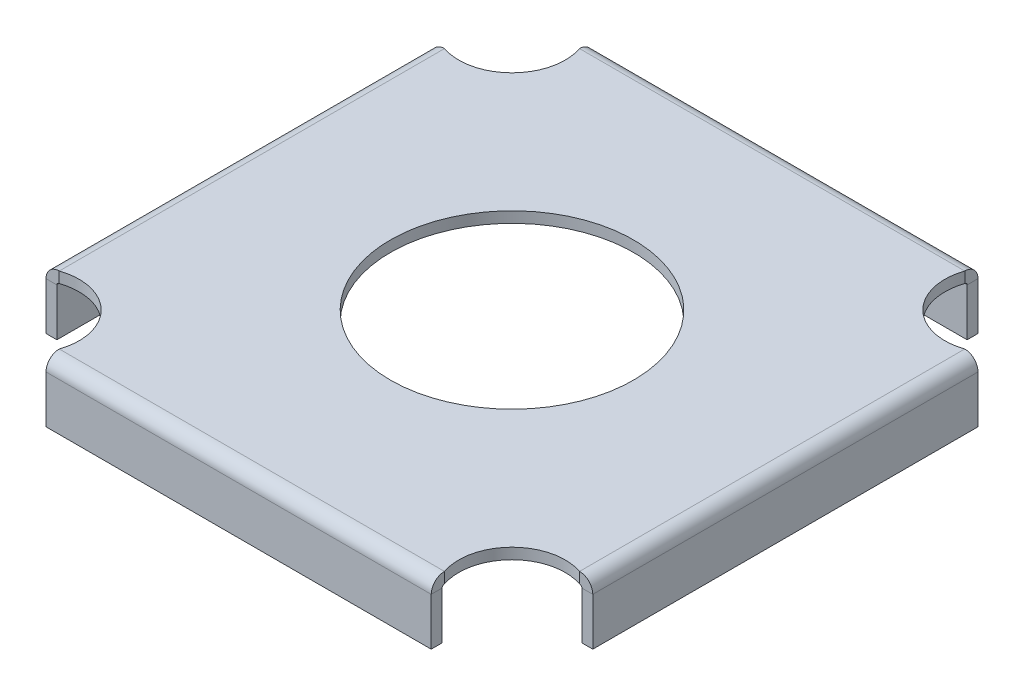
ISO-10303-21;
HEADER;
FILE_DESCRIPTION(('STEP AP214'),'2;1');
FILE_NAME('part.step','',(''),(''),'','','');
FILE_SCHEMA(('AUTOMOTIVE_DESIGN { 1 0 10303 214 1 1 1 1 }'));
ENDSEC;
DATA;
#1=APPLICATION_CONTEXT('core data for automotive mechanical design processes');
#2=APPLICATION_PROTOCOL_DEFINITION('international standard','automotive_design',2000,#1);
#3=PRODUCT_CONTEXT('',#1,'mechanical');
#4=PRODUCT('Part','Part','',(#3));
#5=PRODUCT_RELATED_PRODUCT_CATEGORY('part','',(#4));
#6=PRODUCT_DEFINITION_FORMATION('','',#4);
#7=PRODUCT_DEFINITION_CONTEXT('part definition',#1,'design');
#8=PRODUCT_DEFINITION('design','',#6,#7);
#9=PRODUCT_DEFINITION_SHAPE('','',#8);
#10=(LENGTH_UNIT() NAMED_UNIT(*) SI_UNIT(.MILLI.,.METRE.));
#11=(NAMED_UNIT(*) PLANE_ANGLE_UNIT() SI_UNIT($,.RADIAN.));
#12=(NAMED_UNIT(*) SI_UNIT($,.STERADIAN.) SOLID_ANGLE_UNIT());
#13=UNCERTAINTY_MEASURE_WITH_UNIT(LENGTH_MEASURE(1.E-05),#10,'distance_accuracy_value','');
#14=(GEOMETRIC_REPRESENTATION_CONTEXT(3) GLOBAL_UNCERTAINTY_ASSIGNED_CONTEXT((#13)) GLOBAL_UNIT_ASSIGNED_CONTEXT((#10,
#11,#12)) REPRESENTATION_CONTEXT('',''));
#15=CARTESIAN_POINT('',(0.,0.,0.));
#16=DIRECTION('',(0.,0.,1.));
#17=DIRECTION('',(1.,0.,0.));
#18=AXIS2_PLACEMENT_3D('',#15,#16,#17);
#19=CARTESIAN_POINT('',(76.2,-3.4163,76.2));
#20=DIRECTION('',(0.,1.,0.));
#21=DIRECTION('',(0.,0.,1.));
#22=AXIS2_PLACEMENT_3D('',#19,#20,#21);
#23=CYLINDRICAL_SURFACE('',#22,16.7005);
#24=CARTESIAN_POINT('',(76.2,0.,76.2));
#25=DIRECTION('',(0.,-1.,0.));
#26=DIRECTION('',(0.,0.,1.));
#27=AXIS2_PLACEMENT_3D('',#24,#25,#26);
#28=CIRCLE('',#27,16.7005);
#29=CARTESIAN_POINT('',(60.3828089759907,0.,81.5594));
#30=VERTEX_POINT('',#29);
#31=CARTESIAN_POINT('',(81.5594,0.,60.3828089759907));
#32=VERTEX_POINT('',#31);
#33=EDGE_CURVE('E467',#30,#32,#28,.T.);
#34=ORIENTED_EDGE('',*,*,#33,.F.);
#35=DIRECTION('',(0.,1.,0.));
#36=VECTOR('',#35,1.);
#37=CARTESIAN_POINT('',(60.3828089759907,-3.4163,81.5594));
#38=LINE('',#37,#36);
#39=CARTESIAN_POINT('',(60.3828089759907,-3.41629999999999,81.5594));
#40=VERTEX_POINT('',#39);
#41=EDGE_CURVE('E13',#40,#30,#38,.T.);
#42=ORIENTED_EDGE('',*,*,#41,.F.);
#43=CARTESIAN_POINT('',(76.2,-3.4163,76.2));
#44=DIRECTION('',(0.,-1.,0.));
#45=DIRECTION('',(0.,0.,1.));
#46=AXIS2_PLACEMENT_3D('',#43,#44,#45);
#47=CIRCLE('',#46,16.7005);
#48=CARTESIAN_POINT('',(81.5594,-3.4163,60.3828089759907));
#49=VERTEX_POINT('',#48);
#50=EDGE_CURVE('E470',#40,#49,#47,.T.);
#51=ORIENTED_EDGE('',*,*,#50,.T.);
#52=DIRECTION('',(0.,1.,0.));
#53=VECTOR('',#52,1.);
#54=CARTESIAN_POINT('',(81.5594,-3.4163,60.3828089759907));
#55=LINE('',#54,#53);
#56=EDGE_CURVE('E124',#49,#32,#55,.T.);
#57=ORIENTED_EDGE('',*,*,#56,.T.);
#58=EDGE_LOOP('',(#34,#42,#51,#57));
#59=FACE_BOUND('',#58,.T.);
#60=ADVANCED_FACE('F121',(#59),#23,.F.);
#61=CARTESIAN_POINT('',(-76.2,-3.4163,76.2));
#62=DIRECTION('',(0.,1.,0.));
#63=DIRECTION('',(0.,0.,1.));
#64=AXIS2_PLACEMENT_3D('',#61,#62,#63);
#65=CYLINDRICAL_SURFACE('',#64,16.7005);
#66=CARTESIAN_POINT('',(-76.2,0.,76.2));
#67=DIRECTION('',(0.,-1.,0.));
#68=DIRECTION('',(0.,0.,1.));
#69=AXIS2_PLACEMENT_3D('',#66,#67,#68);
#70=CIRCLE('',#69,16.7005);
#71=CARTESIAN_POINT('',(-81.5594,0.,60.3828089759907));
#72=VERTEX_POINT('',#71);
#73=CARTESIAN_POINT('',(-60.3828089759907,0.,81.5594));
#74=VERTEX_POINT('',#73);
#75=EDGE_CURVE('E508',#72,#74,#70,.T.);
#76=ORIENTED_EDGE('',*,*,#75,.F.);
#77=DIRECTION('',(0.,1.,0.));
#78=VECTOR('',#77,1.);
#79=CARTESIAN_POINT('',(-81.5594,-3.4163,60.3828089759907));
#80=LINE('',#79,#78);
#81=CARTESIAN_POINT('',(-81.5594,-3.4163,60.3828089759907));
#82=VERTEX_POINT('',#81);
#83=EDGE_CURVE('E515',#82,#72,#80,.T.);
#84=ORIENTED_EDGE('',*,*,#83,.F.);
#85=CARTESIAN_POINT('',(-76.2,-3.4163,76.2));
#86=DIRECTION('',(0.,-1.,0.));
#87=DIRECTION('',(0.,0.,1.));
#88=AXIS2_PLACEMENT_3D('',#85,#86,#87);
#89=CIRCLE('',#88,16.7005);
#90=CARTESIAN_POINT('',(-60.3828089759907,-3.41629999999999,81.5594));
#91=VERTEX_POINT('',#90);
#92=EDGE_CURVE('E486',#82,#91,#89,.T.);
#93=ORIENTED_EDGE('',*,*,#92,.T.);
#94=DIRECTION('',(0.,1.,0.));
#95=VECTOR('',#94,1.);
#96=CARTESIAN_POINT('',(-60.3828089759907,-3.4163,81.5594));
#97=LINE('',#96,#95);
#98=EDGE_CURVE('E129',#91,#74,#97,.T.);
#99=ORIENTED_EDGE('',*,*,#98,.T.);
#100=EDGE_LOOP('',(#76,#84,#93,#99));
#101=FACE_BOUND('',#100,.T.);
#102=ADVANCED_FACE('F547',(#101),#65,.F.);
#103=CARTESIAN_POINT('',(-76.2,-3.4163,-76.2));
#104=DIRECTION('',(0.,1.,0.));
#105=DIRECTION('',(0.,0.,1.));
#106=AXIS2_PLACEMENT_3D('',#103,#104,#105);
#107=CYLINDRICAL_SURFACE('',#106,16.7005);
#108=CARTESIAN_POINT('',(-76.2,0.,-76.2));
#109=DIRECTION('',(0.,-1.,0.));
#110=DIRECTION('',(0.,0.,1.));
#111=AXIS2_PLACEMENT_3D('',#108,#109,#110);
#112=CIRCLE('',#111,16.7005);
#113=CARTESIAN_POINT('',(-60.3828089759907,0.,-81.5594));
#114=VERTEX_POINT('',#113);
#115=CARTESIAN_POINT('',(-81.5594,0.,-60.3828089759907));
#116=VERTEX_POINT('',#115);
#117=EDGE_CURVE('E502',#114,#116,#112,.T.);
#118=ORIENTED_EDGE('',*,*,#117,.F.);
#119=DIRECTION('',(0.,1.,0.));
#120=VECTOR('',#119,1.);
#121=CARTESIAN_POINT('',(-60.3828089759907,-3.4163,-81.5594));
#122=LINE('',#121,#120);
#123=CARTESIAN_POINT('',(-60.3828089759907,-3.4163,-81.5594));
#124=VERTEX_POINT('',#123);
#125=EDGE_CURVE('E520',#124,#114,#122,.T.);
#126=ORIENTED_EDGE('',*,*,#125,.F.);
#127=CARTESIAN_POINT('',(-76.2,-3.4163,-76.2));
#128=DIRECTION('',(0.,-1.,0.));
#129=DIRECTION('',(0.,0.,1.));
#130=AXIS2_PLACEMENT_3D('',#127,#128,#129);
#131=CIRCLE('',#130,16.7005);
#132=CARTESIAN_POINT('',(-81.5594,-3.4163,-60.3828089759907));
#133=VERTEX_POINT('',#132);
#134=EDGE_CURVE('E481',#124,#133,#131,.T.);
#135=ORIENTED_EDGE('',*,*,#134,.T.);
#136=DIRECTION('',(0.,1.,0.));
#137=VECTOR('',#136,1.);
#138=CARTESIAN_POINT('',(-81.5594,-3.4163,-60.3828089759907));
#139=LINE('',#138,#137);
#140=EDGE_CURVE('E517',#133,#116,#139,.T.);
#141=ORIENTED_EDGE('',*,*,#140,.T.);
#142=EDGE_LOOP('',(#118,#126,#135,#141));
#143=FACE_BOUND('',#142,.T.);
#144=ADVANCED_FACE('F593',(#143),#107,.F.);
#145=CARTESIAN_POINT('',(76.2,-3.4163,-76.2));
#146=DIRECTION('',(0.,1.,0.));
#147=DIRECTION('',(0.,0.,1.));
#148=AXIS2_PLACEMENT_3D('',#145,#146,#147);
#149=CYLINDRICAL_SURFACE('',#148,16.7005);
#150=CARTESIAN_POINT('',(76.2,0.,-76.2));
#151=DIRECTION('',(0.,-1.,0.));
#152=DIRECTION('',(0.,0.,1.));
#153=AXIS2_PLACEMENT_3D('',#150,#151,#152);
#154=CIRCLE('',#153,16.7005);
#155=CARTESIAN_POINT('',(81.5594,0.,-60.3828089759907));
#156=VERTEX_POINT('',#155);
#157=CARTESIAN_POINT('',(60.3828089759907,0.,-81.5594));
#158=VERTEX_POINT('',#157);
#159=EDGE_CURVE('E496',#156,#158,#154,.T.);
#160=ORIENTED_EDGE('',*,*,#159,.F.);
#161=DIRECTION('',(0.,1.,0.));
#162=VECTOR('',#161,1.);
#163=CARTESIAN_POINT('',(81.5594,-3.4163,-60.3828089759907));
#164=LINE('',#163,#162);
#165=CARTESIAN_POINT('',(81.5594,-3.4163,-60.3828089759907));
#166=VERTEX_POINT('',#165);
#167=EDGE_CURVE('E525',#166,#156,#164,.T.);
#168=ORIENTED_EDGE('',*,*,#167,.F.);
#169=CARTESIAN_POINT('',(76.2,-3.4163,-76.2));
#170=DIRECTION('',(0.,-1.,0.));
#171=DIRECTION('',(0.,0.,1.));
#172=AXIS2_PLACEMENT_3D('',#169,#170,#171);
#173=CIRCLE('',#172,16.7005);
#174=CARTESIAN_POINT('',(60.3828089759907,-3.4163,-81.5594));
#175=VERTEX_POINT('',#174);
#176=EDGE_CURVE('E476',#166,#175,#173,.T.);
#177=ORIENTED_EDGE('',*,*,#176,.T.);
#178=DIRECTION('',(0.,1.,0.));
#179=VECTOR('',#178,1.);
#180=CARTESIAN_POINT('',(60.3828089759907,-3.4163,-81.5594));
#181=LINE('',#180,#179);
#182=EDGE_CURVE('E523',#175,#158,#181,.T.);
#183=ORIENTED_EDGE('',*,*,#182,.T.);
#184=EDGE_LOOP('',(#160,#168,#177,#183));
#185=FACE_BOUND('',#184,.T.);
#186=ADVANCED_FACE('F598',(#185),#149,.F.);
#187=CARTESIAN_POINT('',(76.2,-3.4163,76.2));
#188=DIRECTION('',(0.,1.,0.));
#189=DIRECTION('',(0.,0.,1.));
#190=AXIS2_PLACEMENT_3D('',#187,#188,#189);
#191=PLANE('',#190);
#192=CARTESIAN_POINT('',(0.,-3.4163,0.));
#193=DIRECTION('',(0.,1.,0.));
#194=DIRECTION('',(0.,0.,1.));
#195=AXIS2_PLACEMENT_3D('',#192,#193,#194);
#196=CIRCLE('',#195,38.1);
#197=CARTESIAN_POINT('',(0.,-3.4163,38.1));
#198=VERTEX_POINT('',#197);
#199=EDGE_CURVE('E464',#198,#198,#196,.T.);
#200=ORIENTED_EDGE('',*,*,#199,.T.);
#201=EDGE_LOOP('',(#200));
#202=FACE_BOUND('',#201,.T.);
#203=ORIENTED_EDGE('',*,*,#50,.F.);
#204=DIRECTION('',(1.,0.,0.));
#205=VECTOR('',#204,1.);
#206=CARTESIAN_POINT('',(60.3828089759907,-3.4163,81.5594));
#207=LINE('',#206,#205);
#208=EDGE_CURVE('E489',#91,#40,#207,.T.);
#209=ORIENTED_EDGE('',*,*,#208,.F.);
#210=ORIENTED_EDGE('',*,*,#92,.F.);
#211=DIRECTION('',(0.,0.,1.));
#212=VECTOR('',#211,1.);
#213=CARTESIAN_POINT('',(-81.5594,-3.4163,60.3828089759907));
#214=LINE('',#213,#212);
#215=EDGE_CURVE('E484',#133,#82,#214,.T.);
#216=ORIENTED_EDGE('',*,*,#215,.F.);
#217=ORIENTED_EDGE('',*,*,#134,.F.);
#218=DIRECTION('',(-1.,0.,0.));
#219=VECTOR('',#218,1.);
#220=CARTESIAN_POINT('',(-60.3828089759907,-3.4163,-81.5594));
#221=LINE('',#220,#219);
#222=EDGE_CURVE('E479',#175,#124,#221,.T.);
#223=ORIENTED_EDGE('',*,*,#222,.F.);
#224=ORIENTED_EDGE('',*,*,#176,.F.);
#225=DIRECTION('',(0.,0.,-1.));
#226=VECTOR('',#225,1.);
#227=CARTESIAN_POINT('',(81.5594,-3.4163,-60.3828089759907));
#228=LINE('',#227,#226);
#229=EDGE_CURVE('E473',#49,#166,#228,.T.);
#230=ORIENTED_EDGE('',*,*,#229,.F.);
#231=EDGE_LOOP('',(#203,#209,#210,#216,#217,#223,#224,#230));
#232=FACE_BOUND('',#231,.T.);
#233=ADVANCED_FACE('F553',(#202,#232),#191,.F.);
#234=CARTESIAN_POINT('',(76.2,0.,76.2));
#235=DIRECTION('',(0.,1.,0.));
#236=DIRECTION('',(0.,0.,1.));
#237=AXIS2_PLACEMENT_3D('',#234,#235,#236);
#238=PLANE('',#237);
#239=CARTESIAN_POINT('',(0.,0.,0.));
#240=DIRECTION('',(0.,1.,0.));
#241=DIRECTION('',(0.,0.,1.));
#242=AXIS2_PLACEMENT_3D('',#239,#240,#241);
#243=CIRCLE('',#242,38.1);
#244=CARTESIAN_POINT('',(0.,0.,38.1));
#245=VERTEX_POINT('',#244);
#246=EDGE_CURVE('E455',#245,#245,#243,.T.);
#247=ORIENTED_EDGE('',*,*,#246,.F.);
#248=EDGE_LOOP('',(#247));
#249=FACE_BOUND('',#248,.T.);
#250=ORIENTED_EDGE('',*,*,#33,.T.);
#251=DIRECTION('',(0.,0.,-1.));
#252=VECTOR('',#251,1.);
#253=CARTESIAN_POINT('',(81.5594,0.,-60.3828089759907));
#254=LINE('',#253,#252);
#255=EDGE_CURVE('E493',#32,#156,#254,.T.);
#256=ORIENTED_EDGE('',*,*,#255,.T.);
#257=ORIENTED_EDGE('',*,*,#159,.T.);
#258=DIRECTION('',(-1.,0.,0.));
#259=VECTOR('',#258,1.);
#260=CARTESIAN_POINT('',(-60.3828089759907,0.,-81.5594));
#261=LINE('',#260,#259);
#262=EDGE_CURVE('E499',#158,#114,#261,.T.);
#263=ORIENTED_EDGE('',*,*,#262,.T.);
#264=ORIENTED_EDGE('',*,*,#117,.T.);
#265=DIRECTION('',(0.,0.,1.));
#266=VECTOR('',#265,1.);
#267=CARTESIAN_POINT('',(-81.5594,0.,60.3828089759907));
#268=LINE('',#267,#266);
#269=EDGE_CURVE('E505',#116,#72,#268,.T.);
#270=ORIENTED_EDGE('',*,*,#269,.T.);
#271=ORIENTED_EDGE('',*,*,#75,.T.);
#272=DIRECTION('',(1.,0.,0.));
#273=VECTOR('',#272,1.);
#274=CARTESIAN_POINT('',(60.3828089759907,0.,81.5594));
#275=LINE('',#274,#273);
#276=EDGE_CURVE('E474',#74,#30,#275,.T.);
#277=ORIENTED_EDGE('',*,*,#276,.T.);
#278=EDGE_LOOP('',(#250,#256,#257,#263,#264,#270,#271,#277));
#279=FACE_BOUND('',#278,.T.);
#280=ADVANCED_FACE('F539',(#249,#279),#238,.T.);
#281=CARTESIAN_POINT('',(0.,-3.4163,0.));
#282=DIRECTION('',(0.,1.,0.));
#283=DIRECTION('',(0.,0.,1.));
#284=AXIS2_PLACEMENT_3D('',#281,#282,#283);
#285=CYLINDRICAL_SURFACE('',#284,38.1);
#286=ORIENTED_EDGE('',*,*,#199,.F.);
#287=EDGE_LOOP('',(#286));
#288=FACE_BOUND('',#287,.T.);
#289=ORIENTED_EDGE('',*,*,#246,.T.);
#290=EDGE_LOOP('',(#289));
#291=FACE_BOUND('',#290,.T.);
#292=ADVANCED_FACE('F712',(#288,#291),#285,.F.);
#293=CARTESIAN_POINT('',(60.3828089759907,-4.15289999999999,81.5594));
#294=DIRECTION('',(1.,0.,0.));
#295=DIRECTION('',(0.,0.,-1.));
#296=AXIS2_PLACEMENT_3D('',#293,#294,#295);
#297=PLANE('',#296);
#298=DIRECTION('',(0.,0.,1.));
#299=VECTOR('',#298,1.);
#300=CARTESIAN_POINT('',(60.3828089759907,-4.1529,85.7123));
#301=LINE('',#300,#299);
#302=CARTESIAN_POINT('',(60.3828089759907,-4.15289999999999,82.296));
#303=VERTEX_POINT('',#302);
#304=CARTESIAN_POINT('',(60.3828089759907,-4.15289999999998,85.7123));
#305=VERTEX_POINT('',#304);
#306=EDGE_CURVE('E413',#303,#305,#301,.T.);
#307=ORIENTED_EDGE('',*,*,#306,.F.);
#308=CARTESIAN_POINT('',(60.3828089759907,-4.15289999999999,81.5594));
#309=DIRECTION('',(-1.,0.,0.));
#310=DIRECTION('',(0.,0.,1.));
#311=AXIS2_PLACEMENT_3D('',#308,#309,#310);
#312=CIRCLE('',#311,0.736600000000004);
#313=EDGE_CURVE('E459',#40,#303,#312,.F.);
#314=ORIENTED_EDGE('',*,*,#313,.F.);
#315=ORIENTED_EDGE('',*,*,#41,.T.);
#316=CARTESIAN_POINT('',(60.3828089759907,-4.15289999999999,81.5594));
#317=DIRECTION('',(-1.,0.,0.));
#318=DIRECTION('',(0.,0.,1.));
#319=AXIS2_PLACEMENT_3D('',#316,#317,#318);
#320=CIRCLE('',#319,4.1529);
#321=EDGE_CURVE('E137',#30,#305,#320,.F.);
#322=ORIENTED_EDGE('',*,*,#321,.T.);
#323=EDGE_LOOP('',(#307,#314,#315,#322));
#324=FACE_BOUND('',#323,.T.);
#325=ADVANCED_FACE('F560',(#324),#297,.T.);
#326=CARTESIAN_POINT('',(-60.3828089759907,-4.15289999999999,81.5594));
#327=DIRECTION('',(1.,0.,0.));
#328=DIRECTION('',(0.,0.,-1.));
#329=AXIS2_PLACEMENT_3D('',#326,#327,#328);
#330=PLANE('',#329);
#331=CARTESIAN_POINT('',(-60.3828089759907,-4.15289999999999,81.5594));
#332=DIRECTION('',(-1.,0.,0.));
#333=DIRECTION('',(0.,0.,1.));
#334=AXIS2_PLACEMENT_3D('',#331,#332,#333);
#335=CIRCLE('',#334,0.736600000000004);
#336=CARTESIAN_POINT('',(-60.3828089759907,-4.15289999999999,82.296));
#337=VERTEX_POINT('',#336);
#338=EDGE_CURVE('E424',#337,#91,#335,.T.);
#339=ORIENTED_EDGE('',*,*,#338,.F.);
#340=DIRECTION('',(0.,0.,1.));
#341=VECTOR('',#340,1.);
#342=CARTESIAN_POINT('',(-60.3828089759907,-4.15289999999999,82.296));
#343=LINE('',#342,#341);
#344=CARTESIAN_POINT('',(-60.3828089759907,-4.15289999999999,85.7123));
#345=VERTEX_POINT('',#344);
#346=EDGE_CURVE('E447',#337,#345,#343,.T.);
#347=ORIENTED_EDGE('',*,*,#346,.T.);
#348=CARTESIAN_POINT('',(-60.3828089759907,-4.15289999999999,81.5594));
#349=DIRECTION('',(-1.,0.,0.));
#350=DIRECTION('',(0.,0.,1.));
#351=AXIS2_PLACEMENT_3D('',#348,#349,#350);
#352=CIRCLE('',#351,4.1529);
#353=EDGE_CURVE('E456',#345,#74,#352,.T.);
#354=ORIENTED_EDGE('',*,*,#353,.T.);
#355=ORIENTED_EDGE('',*,*,#98,.F.);
#356=EDGE_LOOP('',(#339,#347,#354,#355));
#357=FACE_BOUND('',#356,.T.);
#358=ADVANCED_FACE('F544',(#357),#330,.F.);
#359=CARTESIAN_POINT('',(-60.3828089759907,-4.15289999999999,81.5594));
#360=DIRECTION('',(-1.,0.,0.));
#361=DIRECTION('',(0.,0.,1.));
#362=AXIS2_PLACEMENT_3D('',#359,#360,#361);
#363=CYLINDRICAL_SURFACE('',#362,4.1529);
#364=ORIENTED_EDGE('',*,*,#276,.F.);
#365=ORIENTED_EDGE('',*,*,#353,.F.);
#366=DIRECTION('',(-1.,0.,0.));
#367=VECTOR('',#366,1.);
#368=CARTESIAN_POINT('',(0.,-4.15289999999999,85.7123));
#369=LINE('',#368,#367);
#370=EDGE_CURVE('E444',#305,#345,#369,.T.);
#371=ORIENTED_EDGE('',*,*,#370,.F.);
#372=ORIENTED_EDGE('',*,*,#321,.F.);
#373=EDGE_LOOP('',(#364,#365,#371,#372));
#374=FACE_BOUND('',#373,.T.);
#375=ADVANCED_FACE('F541',(#374),#363,.T.);
#376=CARTESIAN_POINT('',(-60.3828089759907,-4.15289999999999,81.5594));
#377=DIRECTION('',(-1.,0.,0.));
#378=DIRECTION('',(0.,0.,1.));
#379=AXIS2_PLACEMENT_3D('',#376,#377,#378);
#380=CYLINDRICAL_SURFACE('',#379,0.736600000000004);
#381=ORIENTED_EDGE('',*,*,#208,.T.);
#382=ORIENTED_EDGE('',*,*,#313,.T.);
#383=DIRECTION('',(1.,0.,0.));
#384=VECTOR('',#383,1.);
#385=CARTESIAN_POINT('',(60.3828089759907,-4.1529,82.296));
#386=LINE('',#385,#384);
#387=EDGE_CURVE('E450',#303,#337,#386,.F.);
#388=ORIENTED_EDGE('',*,*,#387,.T.);
#389=ORIENTED_EDGE('',*,*,#338,.T.);
#390=EDGE_LOOP('',(#381,#382,#388,#389));
#391=FACE_BOUND('',#390,.T.);
#392=ADVANCED_FACE('F557',(#391),#380,.F.);
#393=CARTESIAN_POINT('',(-60.3828089759907,-3.41629999999999,85.7123));
#394=DIRECTION('',(-1.,0.,0.));
#395=DIRECTION('',(0.,0.,1.));
#396=AXIS2_PLACEMENT_3D('',#393,#394,#395);
#397=PLANE('',#396);
#398=DIRECTION('',(0.,1.,0.));
#399=VECTOR('',#398,1.);
#400=CARTESIAN_POINT('',(-60.3828089759907,-3.41629999999999,85.7123));
#401=LINE('',#400,#399);
#402=CARTESIAN_POINT('',(-60.3828089759907,-19.05,85.7123));
#403=VERTEX_POINT('',#402);
#404=EDGE_CURVE('E428',#403,#345,#401,.T.);
#405=ORIENTED_EDGE('',*,*,#404,.T.);
#406=ORIENTED_EDGE('',*,*,#346,.F.);
#407=DIRECTION('',(0.,-1.,0.));
#408=VECTOR('',#407,1.);
#409=CARTESIAN_POINT('',(-60.3828089759907,2.17196961742773E-13,82.296));
#410=LINE('',#409,#408);
#411=CARTESIAN_POINT('',(-60.3828089759907,-19.05,82.296));
#412=VERTEX_POINT('',#411);
#413=EDGE_CURVE('E436',#412,#337,#410,.F.);
#414=ORIENTED_EDGE('',*,*,#413,.F.);
#415=DIRECTION('',(0.,0.,-1.));
#416=VECTOR('',#415,1.);
#417=CARTESIAN_POINT('',(-60.3828089759907,-19.05,85.7123));
#418=LINE('',#417,#416);
#419=EDGE_CURVE('E422',#403,#412,#418,.T.);
#420=ORIENTED_EDGE('',*,*,#419,.F.);
#421=EDGE_LOOP('',(#405,#406,#414,#420));
#422=FACE_BOUND('',#421,.T.);
#423=ADVANCED_FACE('F577',(#422),#397,.T.);
#424=CARTESIAN_POINT('',(60.3828089759907,-19.05,85.7123));
#425=DIRECTION('',(1.,0.,0.));
#426=DIRECTION('',(0.,0.,-1.));
#427=AXIS2_PLACEMENT_3D('',#424,#425,#426);
#428=PLANE('',#427);
#429=DIRECTION('',(0.,1.,0.));
#430=VECTOR('',#429,1.);
#431=CARTESIAN_POINT('',(60.3828089759907,2.17196961742773E-13,82.296));
#432=LINE('',#431,#430);
#433=CARTESIAN_POINT('',(60.3828089759907,-19.05,82.296));
#434=VERTEX_POINT('',#433);
#435=EDGE_CURVE('E442',#303,#434,#432,.F.);
#436=ORIENTED_EDGE('',*,*,#435,.F.);
#437=ORIENTED_EDGE('',*,*,#306,.T.);
#438=DIRECTION('',(0.,-1.,0.));
#439=VECTOR('',#438,1.);
#440=CARTESIAN_POINT('',(60.3828089759907,-19.05,85.7123));
#441=LINE('',#440,#439);
#442=CARTESIAN_POINT('',(60.3828089759907,-19.05,85.7123));
#443=VERTEX_POINT('',#442);
#444=EDGE_CURVE('E434',#305,#443,#441,.T.);
#445=ORIENTED_EDGE('',*,*,#444,.T.);
#446=DIRECTION('',(0.,0.,-1.));
#447=VECTOR('',#446,1.);
#448=CARTESIAN_POINT('',(60.3828089759907,-19.05,85.7123));
#449=LINE('',#448,#447);
#450=EDGE_CURVE('E425',#443,#434,#449,.T.);
#451=ORIENTED_EDGE('',*,*,#450,.T.);
#452=EDGE_LOOP('',(#436,#437,#445,#451));
#453=FACE_BOUND('',#452,.T.);
#454=ADVANCED_FACE('F564',(#453),#428,.T.);
#455=CARTESIAN_POINT('',(0.,2.29124909440662E-13,85.7123));
#456=DIRECTION('',(0.,0.,1.));
#457=DIRECTION('',(0.,-1.,0.));
#458=AXIS2_PLACEMENT_3D('',#455,#456,#457);
#459=PLANE('',#458);
#460=ORIENTED_EDGE('',*,*,#444,.F.);
#461=ORIENTED_EDGE('',*,*,#370,.T.);
#462=ORIENTED_EDGE('',*,*,#404,.F.);
#463=DIRECTION('',(-1.,0.,0.));
#464=VECTOR('',#463,1.);
#465=CARTESIAN_POINT('',(-60.3828089759907,-19.05,85.7123));
#466=LINE('',#465,#464);
#467=EDGE_CURVE('E431',#443,#403,#466,.T.);
#468=ORIENTED_EDGE('',*,*,#467,.F.);
#469=EDGE_LOOP('',(#460,#461,#462,#468));
#470=FACE_BOUND('',#469,.T.);
#471=ADVANCED_FACE('F568',(#470),#459,.T.);
#472=CARTESIAN_POINT('',(0.,2.17196961742773E-13,82.296));
#473=DIRECTION('',(0.,0.,1.));
#474=DIRECTION('',(0.,-1.,0.));
#475=AXIS2_PLACEMENT_3D('',#472,#473,#474);
#476=PLANE('',#475);
#477=ORIENTED_EDGE('',*,*,#387,.F.);
#478=ORIENTED_EDGE('',*,*,#435,.T.);
#479=DIRECTION('',(1.,0.,0.));
#480=VECTOR('',#479,1.);
#481=CARTESIAN_POINT('',(0.,-19.05,82.296));
#482=LINE('',#481,#480);
#483=EDGE_CURVE('E439',#434,#412,#482,.F.);
#484=ORIENTED_EDGE('',*,*,#483,.T.);
#485=ORIENTED_EDGE('',*,*,#413,.T.);
#486=EDGE_LOOP('',(#477,#478,#484,#485));
#487=FACE_BOUND('',#486,.T.);
#488=ADVANCED_FACE('F575',(#487),#476,.F.);
#489=CARTESIAN_POINT('',(-60.3828089759907,-19.05,85.7123));
#490=DIRECTION('',(0.,-1.,0.));
#491=DIRECTION('',(0.,0.,-1.));
#492=AXIS2_PLACEMENT_3D('',#489,#490,#491);
#493=PLANE('',#492);
#494=ORIENTED_EDGE('',*,*,#483,.F.);
#495=ORIENTED_EDGE('',*,*,#450,.F.);
#496=ORIENTED_EDGE('',*,*,#467,.T.);
#497=ORIENTED_EDGE('',*,*,#419,.T.);
#498=EDGE_LOOP('',(#494,#495,#496,#497));
#499=FACE_BOUND('',#498,.T.);
#500=ADVANCED_FACE('F572',(#499),#493,.T.);
#501=CARTESIAN_POINT('',(81.5594,-4.1529,-60.3828089759907));
#502=DIRECTION('',(0.,0.,-1.));
#503=DIRECTION('',(-1.,0.,0.));
#504=AXIS2_PLACEMENT_3D('',#501,#502,#503);
#505=PLANE('',#504);
#506=DIRECTION('',(1.,0.,0.));
#507=VECTOR('',#506,1.);
#508=CARTESIAN_POINT('',(85.7123,-4.15289999999999,-60.3828089759907));
#509=LINE('',#508,#507);
#510=CARTESIAN_POINT('',(82.296,-4.1529,-60.3828089759907));
#511=VERTEX_POINT('',#510);
#512=CARTESIAN_POINT('',(85.7123,-4.15289999999999,-60.3828089759907));
#513=VERTEX_POINT('',#512);
#514=EDGE_CURVE('E370',#511,#513,#509,.T.);
#515=ORIENTED_EDGE('',*,*,#514,.F.);
#516=CARTESIAN_POINT('',(81.5594,-4.1529,-60.3828089759907));
#517=DIRECTION('',(0.,0.,1.));
#518=DIRECTION('',(1.,0.,0.));
#519=AXIS2_PLACEMENT_3D('',#516,#517,#518);
#520=CIRCLE('',#519,0.736600000000004);
#521=EDGE_CURVE('E417',#166,#511,#520,.F.);
#522=ORIENTED_EDGE('',*,*,#521,.F.);
#523=ORIENTED_EDGE('',*,*,#167,.T.);
#524=CARTESIAN_POINT('',(81.5594,-4.1529,-60.3828089759907));
#525=DIRECTION('',(0.,0.,1.));
#526=DIRECTION('',(1.,0.,0.));
#527=AXIS2_PLACEMENT_3D('',#524,#525,#526);
#528=CIRCLE('',#527,4.1529);
#529=EDGE_CURVE('E410',#156,#513,#528,.F.);
#530=ORIENTED_EDGE('',*,*,#529,.T.);
#531=EDGE_LOOP('',(#515,#522,#523,#530));
#532=FACE_BOUND('',#531,.T.);
#533=ADVANCED_FACE('F695',(#532),#505,.T.);
#534=CARTESIAN_POINT('',(81.5594,-4.1529,60.3828089759907));
#535=DIRECTION('',(0.,0.,-1.));
#536=DIRECTION('',(-1.,0.,0.));
#537=AXIS2_PLACEMENT_3D('',#534,#535,#536);
#538=PLANE('',#537);
#539=CARTESIAN_POINT('',(81.5594,-4.1529,60.3828089759907));
#540=DIRECTION('',(0.,0.,1.));
#541=DIRECTION('',(1.,0.,0.));
#542=AXIS2_PLACEMENT_3D('',#539,#540,#541);
#543=CIRCLE('',#542,0.736600000000004);
#544=CARTESIAN_POINT('',(82.296,-4.1529,60.3828089759907));
#545=VERTEX_POINT('',#544);
#546=EDGE_CURVE('E381',#545,#49,#543,.T.);
#547=ORIENTED_EDGE('',*,*,#546,.F.);
#548=DIRECTION('',(1.,0.,0.));
#549=VECTOR('',#548,1.);
#550=CARTESIAN_POINT('',(82.296,-4.1529,60.3828089759907));
#551=LINE('',#550,#549);
#552=CARTESIAN_POINT('',(85.7123,-4.15289999999999,60.3828089759907));
#553=VERTEX_POINT('',#552);
#554=EDGE_CURVE('E403',#545,#553,#551,.T.);
#555=ORIENTED_EDGE('',*,*,#554,.T.);
#556=CARTESIAN_POINT('',(81.5594,-4.1529,60.3828089759907));
#557=DIRECTION('',(0.,0.,1.));
#558=DIRECTION('',(1.,0.,0.));
#559=AXIS2_PLACEMENT_3D('',#556,#557,#558);
#560=CIRCLE('',#559,4.1529);
#561=EDGE_CURVE('E414',#553,#32,#560,.T.);
#562=ORIENTED_EDGE('',*,*,#561,.T.);
#563=ORIENTED_EDGE('',*,*,#56,.F.);
#564=EDGE_LOOP('',(#547,#555,#562,#563));
#565=FACE_BOUND('',#564,.T.);
#566=ADVANCED_FACE('F690',(#565),#538,.F.);
#567=CARTESIAN_POINT('',(81.5594,-4.1529,60.3828089759907));
#568=DIRECTION('',(0.,0.,1.));
#569=DIRECTION('',(1.,0.,0.));
#570=AXIS2_PLACEMENT_3D('',#567,#568,#569);
#571=CYLINDRICAL_SURFACE('',#570,4.1529);
#572=ORIENTED_EDGE('',*,*,#255,.F.);
#573=ORIENTED_EDGE('',*,*,#561,.F.);
#574=DIRECTION('',(0.,0.,1.));
#575=VECTOR('',#574,1.);
#576=CARTESIAN_POINT('',(85.7123,-4.15289999999999,-60.3828089759907));
#577=LINE('',#576,#575);
#578=EDGE_CURVE('E401',#553,#513,#577,.F.);
#579=ORIENTED_EDGE('',*,*,#578,.T.);
#580=ORIENTED_EDGE('',*,*,#529,.F.);
#581=EDGE_LOOP('',(#572,#573,#579,#580));
#582=FACE_BOUND('',#581,.T.);
#583=ADVANCED_FACE('F687',(#582),#571,.T.);
#584=CARTESIAN_POINT('',(81.5594,-4.1529,60.3828089759907));
#585=DIRECTION('',(0.,0.,1.));
#586=DIRECTION('',(1.,0.,0.));
#587=AXIS2_PLACEMENT_3D('',#584,#585,#586);
#588=CYLINDRICAL_SURFACE('',#587,0.736600000000004);
#589=ORIENTED_EDGE('',*,*,#229,.T.);
#590=ORIENTED_EDGE('',*,*,#521,.T.);
#591=DIRECTION('',(0.,0.,1.));
#592=VECTOR('',#591,1.);
#593=CARTESIAN_POINT('',(82.296,-4.1529,-60.3828089759907));
#594=LINE('',#593,#592);
#595=EDGE_CURVE('E406',#511,#545,#594,.T.);
#596=ORIENTED_EDGE('',*,*,#595,.T.);
#597=ORIENTED_EDGE('',*,*,#546,.T.);
#598=EDGE_LOOP('',(#589,#590,#596,#597));
#599=FACE_BOUND('',#598,.T.);
#600=ADVANCED_FACE('F685',(#599),#588,.F.);
#601=CARTESIAN_POINT('',(85.7123,-3.41629999999999,-60.3828089759907));
#602=DIRECTION('',(0.,0.,-1.));
#603=DIRECTION('',(-1.,0.,0.));
#604=AXIS2_PLACEMENT_3D('',#601,#602,#603);
#605=PLANE('',#604);
#606=DIRECTION('',(0.,-1.,0.));
#607=VECTOR('',#606,1.);
#608=CARTESIAN_POINT('',(82.296,2.89595948990363E-13,-60.3828089759907));
#609=LINE('',#608,#607);
#610=CARTESIAN_POINT('',(82.2960000000001,-19.05,-60.3828089759907));
#611=VERTEX_POINT('',#610);
#612=EDGE_CURVE('E399',#511,#611,#609,.T.);
#613=ORIENTED_EDGE('',*,*,#612,.F.);
#614=ORIENTED_EDGE('',*,*,#514,.T.);
#615=DIRECTION('',(0.,1.,0.));
#616=VECTOR('',#615,1.);
#617=CARTESIAN_POINT('',(85.7123,-3.41629999999999,-60.3828089759907));
#618=LINE('',#617,#616);
#619=CARTESIAN_POINT('',(85.7123000000001,-19.05,-60.3828089759907));
#620=VERTEX_POINT('',#619);
#621=EDGE_CURVE('E391',#513,#620,#618,.F.);
#622=ORIENTED_EDGE('',*,*,#621,.T.);
#623=DIRECTION('',(-1.,0.,0.));
#624=VECTOR('',#623,1.);
#625=CARTESIAN_POINT('',(85.7123000000001,-19.05,-60.3828089759907));
#626=LINE('',#625,#624);
#627=EDGE_CURVE('E382',#620,#611,#626,.T.);
#628=ORIENTED_EDGE('',*,*,#627,.T.);
#629=EDGE_LOOP('',(#613,#614,#622,#628));
#630=FACE_BOUND('',#629,.T.);
#631=ADVANCED_FACE('F678',(#630),#605,.T.);
#632=CARTESIAN_POINT('',(85.7123000000001,-19.05,60.3828089759907));
#633=DIRECTION('',(0.,0.,1.));
#634=DIRECTION('',(0.,-1.,0.));
#635=AXIS2_PLACEMENT_3D('',#632,#633,#634);
#636=PLANE('',#635);
#637=DIRECTION('',(0.,-1.,0.));
#638=VECTOR('',#637,1.);
#639=CARTESIAN_POINT('',(85.7123000000001,-19.05,60.3828089759907));
#640=LINE('',#639,#638);
#641=CARTESIAN_POINT('',(85.7123000000001,-19.05,60.3828089759907));
#642=VERTEX_POINT('',#641);
#643=EDGE_CURVE('E385',#642,#553,#640,.F.);
#644=ORIENTED_EDGE('',*,*,#643,.T.);
#645=ORIENTED_EDGE('',*,*,#554,.F.);
#646=DIRECTION('',(0.,1.,0.));
#647=VECTOR('',#646,1.);
#648=CARTESIAN_POINT('',(82.296,3.16396380436809E-13,60.3828089759907));
#649=LINE('',#648,#647);
#650=CARTESIAN_POINT('',(82.2960000000001,-19.05,60.3828089759907));
#651=VERTEX_POINT('',#650);
#652=EDGE_CURVE('E393',#651,#545,#649,.T.);
#653=ORIENTED_EDGE('',*,*,#652,.F.);
#654=DIRECTION('',(-1.,0.,0.));
#655=VECTOR('',#654,1.);
#656=CARTESIAN_POINT('',(85.7123000000001,-19.05,60.3828089759907));
#657=LINE('',#656,#655);
#658=EDGE_CURVE('E379',#642,#651,#657,.T.);
#659=ORIENTED_EDGE('',*,*,#658,.F.);
#660=EDGE_LOOP('',(#644,#645,#653,#659));
#661=FACE_BOUND('',#660,.T.);
#662=ADVANCED_FACE('F671',(#661),#636,.T.);
#663=CARTESIAN_POINT('',(85.7123,3.01523896688253E-13,0.));
#664=DIRECTION('',(-1.,0.,0.));
#665=DIRECTION('',(0.,-1.,0.));
#666=AXIS2_PLACEMENT_3D('',#663,#664,#665);
#667=PLANE('',#666);
#668=ORIENTED_EDGE('',*,*,#578,.F.);
#669=ORIENTED_EDGE('',*,*,#643,.F.);
#670=DIRECTION('',(0.,0.,-1.));
#671=VECTOR('',#670,1.);
#672=CARTESIAN_POINT('',(85.7123000000001,-19.05,-60.3828089759907));
#673=LINE('',#672,#671);
#674=EDGE_CURVE('E388',#620,#642,#673,.F.);
#675=ORIENTED_EDGE('',*,*,#674,.F.);
#676=ORIENTED_EDGE('',*,*,#621,.F.);
#677=EDGE_LOOP('',(#668,#669,#675,#676));
#678=FACE_BOUND('',#677,.T.);
#679=ADVANCED_FACE('F667',(#678),#667,.F.);
#680=CARTESIAN_POINT('',(82.296,2.89595948990363E-13,0.));
#681=DIRECTION('',(-1.,0.,0.));
#682=DIRECTION('',(0.,-1.,0.));
#683=AXIS2_PLACEMENT_3D('',#680,#681,#682);
#684=PLANE('',#683);
#685=ORIENTED_EDGE('',*,*,#652,.T.);
#686=ORIENTED_EDGE('',*,*,#595,.F.);
#687=ORIENTED_EDGE('',*,*,#612,.T.);
#688=DIRECTION('',(0.,0.,1.));
#689=VECTOR('',#688,1.);
#690=CARTESIAN_POINT('',(82.2960000000001,-19.05,0.));
#691=LINE('',#690,#689);
#692=EDGE_CURVE('E396',#611,#651,#691,.T.);
#693=ORIENTED_EDGE('',*,*,#692,.T.);
#694=EDGE_LOOP('',(#685,#686,#687,#693));
#695=FACE_BOUND('',#694,.T.);
#696=ADVANCED_FACE('F670',(#695),#684,.T.);
#697=CARTESIAN_POINT('',(85.7123000000001,-19.05,-60.3828089759907));
#698=DIRECTION('',(0.,-1.,0.));
#699=DIRECTION('',(1.,0.,0.));
#700=AXIS2_PLACEMENT_3D('',#697,#698,#699);
#701=PLANE('',#700);
#702=ORIENTED_EDGE('',*,*,#692,.F.);
#703=ORIENTED_EDGE('',*,*,#627,.F.);
#704=ORIENTED_EDGE('',*,*,#674,.T.);
#705=ORIENTED_EDGE('',*,*,#658,.T.);
#706=EDGE_LOOP('',(#702,#703,#704,#705));
#707=FACE_BOUND('',#706,.T.);
#708=ADVANCED_FACE('F664',(#707),#701,.T.);
#709=CARTESIAN_POINT('',(-60.3828089759907,-4.1529,-81.5594));
#710=DIRECTION('',(-1.,0.,0.));
#711=DIRECTION('',(0.,0.,1.));
#712=AXIS2_PLACEMENT_3D('',#709,#710,#711);
#713=PLANE('',#712);
#714=DIRECTION('',(0.,0.,-1.));
#715=VECTOR('',#714,1.);
#716=CARTESIAN_POINT('',(-60.3828089759907,-4.15289999999998,-85.7123));
#717=LINE('',#716,#715);
#718=CARTESIAN_POINT('',(-60.3828089759907,-4.1529,-82.296));
#719=VERTEX_POINT('',#718);
#720=CARTESIAN_POINT('',(-60.3828089759907,-4.15289999999998,-85.7123));
#721=VERTEX_POINT('',#720);
#722=EDGE_CURVE('E327',#719,#721,#717,.T.);
#723=ORIENTED_EDGE('',*,*,#722,.F.);
#724=CARTESIAN_POINT('',(-60.3828089759907,-4.1529,-81.5594));
#725=DIRECTION('',(1.,0.,0.));
#726=DIRECTION('',(0.,0.,-1.));
#727=AXIS2_PLACEMENT_3D('',#724,#725,#726);
#728=CIRCLE('',#727,0.736600000000004);
#729=EDGE_CURVE('E374',#124,#719,#728,.F.);
#730=ORIENTED_EDGE('',*,*,#729,.F.);
#731=ORIENTED_EDGE('',*,*,#125,.T.);
#732=CARTESIAN_POINT('',(-60.3828089759907,-4.1529,-81.5594));
#733=DIRECTION('',(1.,0.,0.));
#734=DIRECTION('',(0.,0.,-1.));
#735=AXIS2_PLACEMENT_3D('',#732,#733,#734);
#736=CIRCLE('',#735,4.1529);
#737=EDGE_CURVE('E367',#114,#721,#736,.F.);
#738=ORIENTED_EDGE('',*,*,#737,.T.);
#739=EDGE_LOOP('',(#723,#730,#731,#738));
#740=FACE_BOUND('',#739,.T.);
#741=ADVANCED_FACE('F635',(#740),#713,.T.);
#742=CARTESIAN_POINT('',(60.3828089759907,-4.1529,-81.5594));
#743=DIRECTION('',(-1.,0.,0.));
#744=DIRECTION('',(0.,0.,1.));
#745=AXIS2_PLACEMENT_3D('',#742,#743,#744);
#746=PLANE('',#745);
#747=CARTESIAN_POINT('',(60.3828089759907,-4.1529,-81.5594));
#748=DIRECTION('',(1.,0.,0.));
#749=DIRECTION('',(0.,0.,-1.));
#750=AXIS2_PLACEMENT_3D('',#747,#748,#749);
#751=CIRCLE('',#750,0.736600000000004);
#752=CARTESIAN_POINT('',(60.3828089759907,-4.1529,-82.296));
#753=VERTEX_POINT('',#752);
#754=EDGE_CURVE('E338',#753,#175,#751,.T.);
#755=ORIENTED_EDGE('',*,*,#754,.F.);
#756=DIRECTION('',(0.,0.,-1.));
#757=VECTOR('',#756,1.);
#758=CARTESIAN_POINT('',(60.3828089759907,-4.15289999999999,-82.296));
#759=LINE('',#758,#757);
#760=CARTESIAN_POINT('',(60.3828089759907,-4.15289999999996,-85.7123));
#761=VERTEX_POINT('',#760);
#762=EDGE_CURVE('E360',#753,#761,#759,.T.);
#763=ORIENTED_EDGE('',*,*,#762,.T.);
#764=CARTESIAN_POINT('',(60.3828089759907,-4.1529,-81.5594));
#765=DIRECTION('',(1.,0.,0.));
#766=DIRECTION('',(0.,0.,-1.));
#767=AXIS2_PLACEMENT_3D('',#764,#765,#766);
#768=CIRCLE('',#767,4.1529);
#769=EDGE_CURVE('E371',#761,#158,#768,.T.);
#770=ORIENTED_EDGE('',*,*,#769,.T.);
#771=ORIENTED_EDGE('',*,*,#182,.F.);
#772=EDGE_LOOP('',(#755,#763,#770,#771));
#773=FACE_BOUND('',#772,.T.);
#774=ADVANCED_FACE('F615',(#773),#746,.F.);
#775=CARTESIAN_POINT('',(60.3828089759907,-4.1529,-81.5594));
#776=DIRECTION('',(1.,0.,0.));
#777=DIRECTION('',(0.,0.,-1.));
#778=AXIS2_PLACEMENT_3D('',#775,#776,#777);
#779=CYLINDRICAL_SURFACE('',#778,4.1529);
#780=ORIENTED_EDGE('',*,*,#262,.F.);
#781=ORIENTED_EDGE('',*,*,#769,.F.);
#782=DIRECTION('',(1.,0.,0.));
#783=VECTOR('',#782,1.);
#784=CARTESIAN_POINT('',(-60.3828089759907,-4.15289999999998,-85.7123));
#785=LINE('',#784,#783);
#786=EDGE_CURVE('E358',#761,#721,#785,.F.);
#787=ORIENTED_EDGE('',*,*,#786,.T.);
#788=ORIENTED_EDGE('',*,*,#737,.F.);
#789=EDGE_LOOP('',(#780,#781,#787,#788));
#790=FACE_BOUND('',#789,.T.);
#791=ADVANCED_FACE('F612',(#790),#779,.T.);
#792=CARTESIAN_POINT('',(60.3828089759907,-4.1529,-81.5594));
#793=DIRECTION('',(1.,0.,0.));
#794=DIRECTION('',(0.,0.,-1.));
#795=AXIS2_PLACEMENT_3D('',#792,#793,#794);
#796=CYLINDRICAL_SURFACE('',#795,0.736600000000004);
#797=ORIENTED_EDGE('',*,*,#222,.T.);
#798=ORIENTED_EDGE('',*,*,#729,.T.);
#799=DIRECTION('',(1.,0.,0.));
#800=VECTOR('',#799,1.);
#801=CARTESIAN_POINT('',(-60.3828089759907,-4.1529,-82.296));
#802=LINE('',#801,#800);
#803=EDGE_CURVE('E363',#719,#753,#802,.T.);
#804=ORIENTED_EDGE('',*,*,#803,.T.);
#805=ORIENTED_EDGE('',*,*,#754,.T.);
#806=EDGE_LOOP('',(#797,#798,#804,#805));
#807=FACE_BOUND('',#806,.T.);
#808=ADVANCED_FACE('F639',(#807),#796,.F.);
#809=CARTESIAN_POINT('',(-60.3828089759907,-3.41629999999999,-85.7123));
#810=DIRECTION('',(-1.,0.,0.));
#811=DIRECTION('',(0.,0.,1.));
#812=AXIS2_PLACEMENT_3D('',#809,#810,#811);
#813=PLANE('',#812);
#814=DIRECTION('',(0.,-1.,0.));
#815=VECTOR('',#814,1.);
#816=CARTESIAN_POINT('',(-60.3828089759907,2.89595948990363E-13,-82.296));
#817=LINE('',#816,#815);
#818=CARTESIAN_POINT('',(-60.3828089759907,-19.05,-82.296));
#819=VERTEX_POINT('',#818);
#820=EDGE_CURVE('E356',#719,#819,#817,.T.);
#821=ORIENTED_EDGE('',*,*,#820,.F.);
#822=ORIENTED_EDGE('',*,*,#722,.T.);
#823=DIRECTION('',(0.,1.,0.));
#824=VECTOR('',#823,1.);
#825=CARTESIAN_POINT('',(-60.3828089759907,-3.41629999999999,-85.7123));
#826=LINE('',#825,#824);
#827=CARTESIAN_POINT('',(-60.3828089759907,-19.05,-85.7123));
#828=VERTEX_POINT('',#827);
#829=EDGE_CURVE('E348',#721,#828,#826,.F.);
#830=ORIENTED_EDGE('',*,*,#829,.T.);
#831=DIRECTION('',(0.,0.,1.));
#832=VECTOR('',#831,1.);
#833=CARTESIAN_POINT('',(-60.3828089759907,-19.05,-85.7123));
#834=LINE('',#833,#832);
#835=EDGE_CURVE('E339',#828,#819,#834,.T.);
#836=ORIENTED_EDGE('',*,*,#835,.T.);
#837=EDGE_LOOP('',(#821,#822,#830,#836));
#838=FACE_BOUND('',#837,.T.);
#839=ADVANCED_FACE('F632',(#838),#813,.T.);
#840=CARTESIAN_POINT('',(60.3828089759907,-19.05,-85.7123));
#841=DIRECTION('',(1.,0.,0.));
#842=DIRECTION('',(0.,1.,0.));
#843=AXIS2_PLACEMENT_3D('',#840,#841,#842);
#844=PLANE('',#843);
#845=DIRECTION('',(0.,-1.,0.));
#846=VECTOR('',#845,1.);
#847=CARTESIAN_POINT('',(60.3828089759907,-19.05,-85.7123));
#848=LINE('',#847,#846);
#849=CARTESIAN_POINT('',(60.3828089759907,-19.05,-85.7123));
#850=VERTEX_POINT('',#849);
#851=EDGE_CURVE('E342',#850,#761,#848,.F.);
#852=ORIENTED_EDGE('',*,*,#851,.T.);
#853=ORIENTED_EDGE('',*,*,#762,.F.);
#854=DIRECTION('',(0.,1.,0.));
#855=VECTOR('',#854,1.);
#856=CARTESIAN_POINT('',(60.3828089759907,3.16396380436809E-13,-82.296));
#857=LINE('',#856,#855);
#858=CARTESIAN_POINT('',(60.3828089759907,-19.05,-82.296));
#859=VERTEX_POINT('',#858);
#860=EDGE_CURVE('E350',#859,#753,#857,.T.);
#861=ORIENTED_EDGE('',*,*,#860,.F.);
#862=DIRECTION('',(0.,0.,1.));
#863=VECTOR('',#862,1.);
#864=CARTESIAN_POINT('',(60.3828089759907,-19.05,-85.7123));
#865=LINE('',#864,#863);
#866=EDGE_CURVE('E336',#850,#859,#865,.T.);
#867=ORIENTED_EDGE('',*,*,#866,.F.);
#868=EDGE_LOOP('',(#852,#853,#861,#867));
#869=FACE_BOUND('',#868,.T.);
#870=ADVANCED_FACE('F625',(#869),#844,.T.);
#871=CARTESIAN_POINT('',(0.,3.01523896688253E-13,-85.7123));
#872=DIRECTION('',(0.,0.,1.));
#873=DIRECTION('',(0.,-1.,0.));
#874=AXIS2_PLACEMENT_3D('',#871,#872,#873);
#875=PLANE('',#874);
#876=ORIENTED_EDGE('',*,*,#786,.F.);
#877=ORIENTED_EDGE('',*,*,#851,.F.);
#878=DIRECTION('',(-1.,0.,0.));
#879=VECTOR('',#878,1.);
#880=CARTESIAN_POINT('',(-60.3828089759907,-19.05,-85.7123));
#881=LINE('',#880,#879);
#882=EDGE_CURVE('E345',#828,#850,#881,.F.);
#883=ORIENTED_EDGE('',*,*,#882,.F.);
#884=ORIENTED_EDGE('',*,*,#829,.F.);
#885=EDGE_LOOP('',(#876,#877,#883,#884));
#886=FACE_BOUND('',#885,.T.);
#887=ADVANCED_FACE('F623',(#886),#875,.F.);
#888=CARTESIAN_POINT('',(0.,2.89595948990363E-13,-82.296));
#889=DIRECTION('',(0.,0.,1.));
#890=DIRECTION('',(0.,-1.,0.));
#891=AXIS2_PLACEMENT_3D('',#888,#889,#890);
#892=PLANE('',#891);
#893=ORIENTED_EDGE('',*,*,#860,.T.);
#894=ORIENTED_EDGE('',*,*,#803,.F.);
#895=ORIENTED_EDGE('',*,*,#820,.T.);
#896=DIRECTION('',(1.,0.,0.));
#897=VECTOR('',#896,1.);
#898=CARTESIAN_POINT('',(0.,-19.05,-82.296));
#899=LINE('',#898,#897);
#900=EDGE_CURVE('E353',#819,#859,#899,.T.);
#901=ORIENTED_EDGE('',*,*,#900,.T.);
#902=EDGE_LOOP('',(#893,#894,#895,#901));
#903=FACE_BOUND('',#902,.T.);
#904=ADVANCED_FACE('F642',(#903),#892,.T.);
#905=CARTESIAN_POINT('',(-60.3828089759907,-19.05,-85.7123));
#906=DIRECTION('',(0.,-1.,0.));
#907=DIRECTION('',(0.,0.,-1.));
#908=AXIS2_PLACEMENT_3D('',#905,#906,#907);
#909=PLANE('',#908);
#910=ORIENTED_EDGE('',*,*,#900,.F.);
#911=ORIENTED_EDGE('',*,*,#835,.F.);
#912=ORIENTED_EDGE('',*,*,#882,.T.);
#913=ORIENTED_EDGE('',*,*,#866,.T.);
#914=EDGE_LOOP('',(#910,#911,#912,#913));
#915=FACE_BOUND('',#914,.T.);
#916=ADVANCED_FACE('F628',(#915),#909,.T.);
#917=CARTESIAN_POINT('',(-81.5594,-4.1529,60.3828089759907));
#918=DIRECTION('',(0.,0.,1.));
#919=DIRECTION('',(1.,0.,0.));
#920=AXIS2_PLACEMENT_3D('',#917,#918,#919);
#921=PLANE('',#920);
#922=DIRECTION('',(-1.,0.,0.));
#923=VECTOR('',#922,1.);
#924=CARTESIAN_POINT('',(-85.7123,-4.15289999999999,60.3828089759907));
#925=LINE('',#924,#923);
#926=CARTESIAN_POINT('',(-82.296,-4.1529,60.3828089759907));
#927=VERTEX_POINT('',#926);
#928=CARTESIAN_POINT('',(-85.7123,-4.15289999999999,60.3828089759907));
#929=VERTEX_POINT('',#928);
#930=EDGE_CURVE('E323',#927,#929,#925,.T.);
#931=ORIENTED_EDGE('',*,*,#930,.F.);
#932=CARTESIAN_POINT('',(-81.5594,-4.1529,60.3828089759907));
#933=DIRECTION('',(0.,0.,-1.));
#934=DIRECTION('',(-1.,0.,0.));
#935=AXIS2_PLACEMENT_3D('',#932,#933,#934);
#936=CIRCLE('',#935,0.736600000000004);
#937=EDGE_CURVE('E331',#82,#927,#936,.F.);
#938=ORIENTED_EDGE('',*,*,#937,.F.);
#939=ORIENTED_EDGE('',*,*,#83,.T.);
#940=CARTESIAN_POINT('',(-81.5594,-4.1529,60.3828089759907));
#941=DIRECTION('',(0.,0.,-1.));
#942=DIRECTION('',(-1.,0.,0.));
#943=AXIS2_PLACEMENT_3D('',#940,#941,#942);
#944=CIRCLE('',#943,4.1529);
#945=EDGE_CURVE('E144',#72,#929,#944,.F.);
#946=ORIENTED_EDGE('',*,*,#945,.T.);
#947=EDGE_LOOP('',(#931,#938,#939,#946));
#948=FACE_BOUND('',#947,.T.);
#949=ADVANCED_FACE('F649',(#948),#921,.T.);
#950=CARTESIAN_POINT('',(-81.5594,-4.1529,-60.3828089759907));
#951=DIRECTION('',(0.,0.,1.));
#952=DIRECTION('',(1.,0.,0.));
#953=AXIS2_PLACEMENT_3D('',#950,#951,#952);
#954=PLANE('',#953);
#955=CARTESIAN_POINT('',(-81.5594,-4.1529,-60.3828089759907));
#956=DIRECTION('',(0.,0.,-1.));
#957=DIRECTION('',(-1.,0.,0.));
#958=AXIS2_PLACEMENT_3D('',#955,#956,#957);
#959=CIRCLE('',#958,0.736600000000004);
#960=CARTESIAN_POINT('',(-82.296,-4.1529,-60.3828089759907));
#961=VERTEX_POINT('',#960);
#962=EDGE_CURVE('E293',#961,#133,#959,.T.);
#963=ORIENTED_EDGE('',*,*,#962,.F.);
#964=DIRECTION('',(-1.,0.,0.));
#965=VECTOR('',#964,1.);
#966=CARTESIAN_POINT('',(-82.296,-4.1529,-60.3828089759907));
#967=LINE('',#966,#965);
#968=CARTESIAN_POINT('',(-85.7123,-4.15289999999999,-60.3828089759907));
#969=VERTEX_POINT('',#968);
#970=EDGE_CURVE('E318',#961,#969,#967,.T.);
#971=ORIENTED_EDGE('',*,*,#970,.T.);
#972=CARTESIAN_POINT('',(-81.5594,-4.1529,-60.3828089759907));
#973=DIRECTION('',(0.,0.,-1.));
#974=DIRECTION('',(-1.,0.,0.));
#975=AXIS2_PLACEMENT_3D('',#972,#973,#974);
#976=CIRCLE('',#975,4.1529);
#977=EDGE_CURVE('E328',#969,#116,#976,.T.);
#978=ORIENTED_EDGE('',*,*,#977,.T.);
#979=ORIENTED_EDGE('',*,*,#140,.F.);
#980=EDGE_LOOP('',(#963,#971,#978,#979));
#981=FACE_BOUND('',#980,.T.);
#982=ADVANCED_FACE('F887',(#981),#954,.F.);
#983=CARTESIAN_POINT('',(-81.5594,-4.1529,-60.3828089759907));
#984=DIRECTION('',(0.,0.,-1.));
#985=DIRECTION('',(-1.,0.,0.));
#986=AXIS2_PLACEMENT_3D('',#983,#984,#985);
#987=CYLINDRICAL_SURFACE('',#986,4.1529);
#988=ORIENTED_EDGE('',*,*,#269,.F.);
#989=ORIENTED_EDGE('',*,*,#977,.F.);
#990=DIRECTION('',(0.,0.,-1.));
#991=VECTOR('',#990,1.);
#992=CARTESIAN_POINT('',(-85.7123,-4.15289999999999,60.3828089759907));
#993=LINE('',#992,#991);
#994=EDGE_CURVE('E302',#969,#929,#993,.F.);
#995=ORIENTED_EDGE('',*,*,#994,.T.);
#996=ORIENTED_EDGE('',*,*,#945,.F.);
#997=EDGE_LOOP('',(#988,#989,#995,#996));
#998=FACE_BOUND('',#997,.T.);
#999=ADVANCED_FACE('F897',(#998),#987,.T.);
#1000=CARTESIAN_POINT('',(-81.5594,-4.1529,-60.3828089759907));
#1001=DIRECTION('',(0.,0.,-1.));
#1002=DIRECTION('',(-1.,0.,0.));
#1003=AXIS2_PLACEMENT_3D('',#1000,#1001,#1002);
#1004=CYLINDRICAL_SURFACE('',#1003,0.736600000000004);
#1005=ORIENTED_EDGE('',*,*,#215,.T.);
#1006=ORIENTED_EDGE('',*,*,#937,.T.);
#1007=DIRECTION('',(0.,0.,-1.));
#1008=VECTOR('',#1007,1.);
#1009=CARTESIAN_POINT('',(-82.296,-4.1529,60.3828089759907));
#1010=LINE('',#1009,#1008);
#1011=EDGE_CURVE('E321',#927,#961,#1010,.T.);
#1012=ORIENTED_EDGE('',*,*,#1011,.T.);
#1013=ORIENTED_EDGE('',*,*,#962,.T.);
#1014=EDGE_LOOP('',(#1005,#1006,#1012,#1013));
#1015=FACE_BOUND('',#1014,.T.);
#1016=ADVANCED_FACE('F906',(#1015),#1004,.F.);
#1017=CARTESIAN_POINT('',(-85.7123,-3.41629999999999,60.3828089759907));
#1018=DIRECTION('',(0.,0.,1.));
#1019=DIRECTION('',(1.,0.,0.));
#1020=AXIS2_PLACEMENT_3D('',#1017,#1018,#1019);
#1021=PLANE('',#1020);
#1022=DIRECTION('',(0.,-1.,0.));
#1023=VECTOR('',#1022,1.);
#1024=CARTESIAN_POINT('',(-82.296,2.89595948990363E-13,60.3828089759907));
#1025=LINE('',#1024,#1023);
#1026=CARTESIAN_POINT('',(-82.296,-19.05,60.3828089759907));
#1027=VERTEX_POINT('',#1026);
#1028=EDGE_CURVE('E315',#927,#1027,#1025,.T.);
#1029=ORIENTED_EDGE('',*,*,#1028,.F.);
#1030=ORIENTED_EDGE('',*,*,#930,.T.);
#1031=DIRECTION('',(0.,1.,0.));
#1032=VECTOR('',#1031,1.);
#1033=CARTESIAN_POINT('',(-85.7123,-3.41629999999999,60.3828089759907));
#1034=LINE('',#1033,#1032);
#1035=CARTESIAN_POINT('',(-85.7123,-19.05,60.3828089759907));
#1036=VERTEX_POINT('',#1035);
#1037=EDGE_CURVE('E307',#929,#1036,#1034,.F.);
#1038=ORIENTED_EDGE('',*,*,#1037,.T.);
#1039=DIRECTION('',(1.,0.,0.));
#1040=VECTOR('',#1039,1.);
#1041=CARTESIAN_POINT('',(-85.7123,-19.05,60.3828089759907));
#1042=LINE('',#1041,#1040);
#1043=EDGE_CURVE('E294',#1036,#1027,#1042,.T.);
#1044=ORIENTED_EDGE('',*,*,#1043,.T.);
#1045=EDGE_LOOP('',(#1029,#1030,#1038,#1044));
#1046=FACE_BOUND('',#1045,.T.);
#1047=ADVANCED_FACE('F915',(#1046),#1021,.T.);
#1048=CARTESIAN_POINT('',(-85.7123,-19.05,-60.3828089759907));
#1049=DIRECTION('',(0.,0.,-1.));
#1050=DIRECTION('',(0.,1.,0.));
#1051=AXIS2_PLACEMENT_3D('',#1048,#1049,#1050);
#1052=PLANE('',#1051);
#1053=DIRECTION('',(0.,-1.,0.));
#1054=VECTOR('',#1053,1.);
#1055=CARTESIAN_POINT('',(-85.7123,-19.05,-60.3828089759907));
#1056=LINE('',#1055,#1054);
#1057=CARTESIAN_POINT('',(-85.7123,-19.05,-60.3828089759907));
#1058=VERTEX_POINT('',#1057);
#1059=EDGE_CURVE('E286',#1058,#969,#1056,.F.);
#1060=ORIENTED_EDGE('',*,*,#1059,.T.);
#1061=ORIENTED_EDGE('',*,*,#970,.F.);
#1062=DIRECTION('',(0.,1.,0.));
#1063=VECTOR('',#1062,1.);
#1064=CARTESIAN_POINT('',(-82.296,2.62795517543918E-13,-60.3828089759907));
#1065=LINE('',#1064,#1063);
#1066=CARTESIAN_POINT('',(-82.296,-19.05,-60.3828089759907));
#1067=VERTEX_POINT('',#1066);
#1068=EDGE_CURVE('E288',#1067,#961,#1065,.T.);
#1069=ORIENTED_EDGE('',*,*,#1068,.F.);
#1070=DIRECTION('',(1.,0.,0.));
#1071=VECTOR('',#1070,1.);
#1072=CARTESIAN_POINT('',(-85.7123,-19.05,-60.3828089759907));
#1073=LINE('',#1072,#1071);
#1074=EDGE_CURVE('E282',#1058,#1067,#1073,.T.);
#1075=ORIENTED_EDGE('',*,*,#1074,.F.);
#1076=EDGE_LOOP('',(#1060,#1061,#1069,#1075));
#1077=FACE_BOUND('',#1076,.T.);
#1078=ADVANCED_FACE('F284',(#1077),#1052,.T.);
#1079=CARTESIAN_POINT('',(-85.7123,3.01523896688253E-13,0.));
#1080=DIRECTION('',(1.,0.,0.));
#1081=DIRECTION('',(0.,1.,0.));
#1082=AXIS2_PLACEMENT_3D('',#1079,#1080,#1081);
#1083=PLANE('',#1082);
#1084=ORIENTED_EDGE('',*,*,#994,.F.);
#1085=ORIENTED_EDGE('',*,*,#1059,.F.);
#1086=DIRECTION('',(0.,0.,1.));
#1087=VECTOR('',#1086,1.);
#1088=CARTESIAN_POINT('',(-85.7123,-19.05,60.3828089759907));
#1089=LINE('',#1088,#1087);
#1090=EDGE_CURVE('E301',#1036,#1058,#1089,.F.);
#1091=ORIENTED_EDGE('',*,*,#1090,.F.);
#1092=ORIENTED_EDGE('',*,*,#1037,.F.);
#1093=EDGE_LOOP('',(#1084,#1085,#1091,#1092));
#1094=FACE_BOUND('',#1093,.T.);
#1095=ADVANCED_FACE('F299',(#1094),#1083,.F.);
#1096=CARTESIAN_POINT('',(-82.296,2.89595948990363E-13,0.));
#1097=DIRECTION('',(1.,0.,0.));
#1098=DIRECTION('',(0.,1.,0.));
#1099=AXIS2_PLACEMENT_3D('',#1096,#1097,#1098);
#1100=PLANE('',#1099);
#1101=ORIENTED_EDGE('',*,*,#1068,.T.);
#1102=ORIENTED_EDGE('',*,*,#1011,.F.);
#1103=ORIENTED_EDGE('',*,*,#1028,.T.);
#1104=DIRECTION('',(0.,0.,-1.));
#1105=VECTOR('',#1104,1.);
#1106=CARTESIAN_POINT('',(-82.296,-19.05,0.));
#1107=LINE('',#1106,#1105);
#1108=EDGE_CURVE('E313',#1027,#1067,#1107,.T.);
#1109=ORIENTED_EDGE('',*,*,#1108,.T.);
#1110=EDGE_LOOP('',(#1101,#1102,#1103,#1109));
#1111=FACE_BOUND('',#1110,.T.);
#1112=ADVANCED_FACE('F942',(#1111),#1100,.T.);
#1113=CARTESIAN_POINT('',(-85.7123,-19.05,60.3828089759907));
#1114=DIRECTION('',(0.,-1.,0.));
#1115=DIRECTION('',(1.,0.,0.));
#1116=AXIS2_PLACEMENT_3D('',#1113,#1114,#1115);
#1117=PLANE('',#1116);
#1118=ORIENTED_EDGE('',*,*,#1108,.F.);
#1119=ORIENTED_EDGE('',*,*,#1043,.F.);
#1120=ORIENTED_EDGE('',*,*,#1090,.T.);
#1121=ORIENTED_EDGE('',*,*,#1074,.T.);
#1122=EDGE_LOOP('',(#1118,#1119,#1120,#1121));
#1123=FACE_BOUND('',#1122,.T.);
#1124=ADVANCED_FACE('F305',(#1123),#1117,.T.);
#1125=CLOSED_SHELL('',(#60,#102,#144,#186,#233,#280,#292,#325,#358,#375,#392,#423,#454,#471,
#488,#500,#533,#566,#583,#600,#631,#662,#679,#696,#708,#741,#774,#791,#808,#839,#870,#887,#904,
#916,#949,#982,#999,#1016,#1047,#1078,#1095,#1112,#1124));
#1126=MANIFOLD_SOLID_BREP('B2',#1125);
#1127=ADVANCED_BREP_SHAPE_REPRESENTATION('',(#18,#1126),#14);
#1128=SHAPE_DEFINITION_REPRESENTATION(#9,#1127);
ENDSEC;
END-ISO-10303-21;
